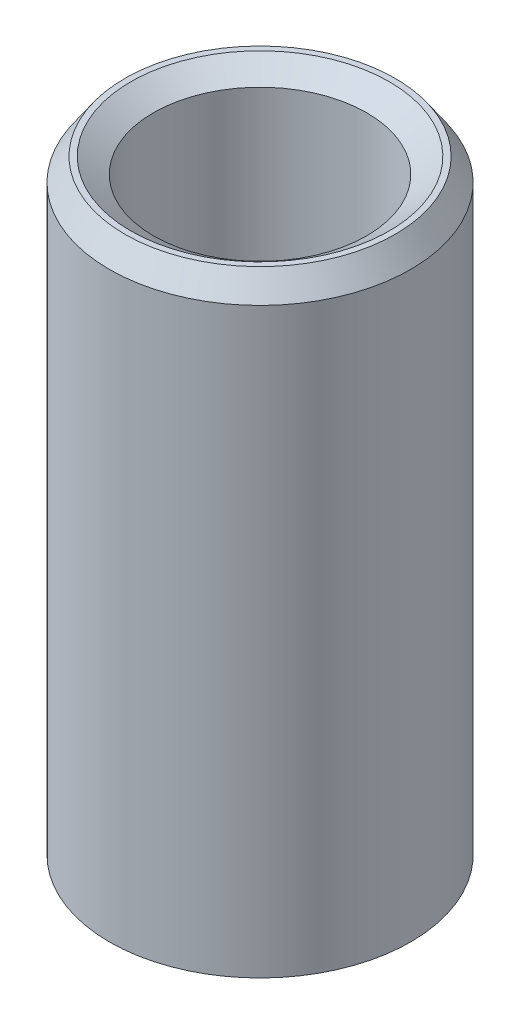
ISO-10303-21;
HEADER;
FILE_DESCRIPTION(('STEP AP214'),'2;1');
FILE_NAME('part.step','',(''),(''),'','','');
FILE_SCHEMA(('AUTOMOTIVE_DESIGN { 1 0 10303 214 1 1 1 1 }'));
ENDSEC;
DATA;
#1=APPLICATION_CONTEXT('core data for automotive mechanical design processes');
#2=APPLICATION_PROTOCOL_DEFINITION('international standard','automotive_design',2000,#1);
#3=PRODUCT_CONTEXT('',#1,'mechanical');
#4=PRODUCT('Part','Part','',(#3));
#5=PRODUCT_RELATED_PRODUCT_CATEGORY('part','',(#4));
#6=PRODUCT_DEFINITION_FORMATION('','',#4);
#7=PRODUCT_DEFINITION_CONTEXT('part definition',#1,'design');
#8=PRODUCT_DEFINITION('design','',#6,#7);
#9=PRODUCT_DEFINITION_SHAPE('','',#8);
#10=(LENGTH_UNIT() NAMED_UNIT(*) SI_UNIT(.MILLI.,.METRE.));
#11=(NAMED_UNIT(*) PLANE_ANGLE_UNIT() SI_UNIT($,.RADIAN.));
#12=(NAMED_UNIT(*) SI_UNIT($,.STERADIAN.) SOLID_ANGLE_UNIT());
#13=UNCERTAINTY_MEASURE_WITH_UNIT(LENGTH_MEASURE(1.E-05),#10,'distance_accuracy_value','');
#14=(GEOMETRIC_REPRESENTATION_CONTEXT(3) GLOBAL_UNCERTAINTY_ASSIGNED_CONTEXT((#13)) GLOBAL_UNIT_ASSIGNED_CONTEXT((#10,
#11,#12)) REPRESENTATION_CONTEXT('',''));
#15=CARTESIAN_POINT('',(0.,0.,0.));
#16=DIRECTION('',(0.,0.,1.));
#17=DIRECTION('',(1.,0.,0.));
#18=AXIS2_PLACEMENT_3D('',#15,#16,#17);
#19=CARTESIAN_POINT('',(0.,61.7826285596453,0.));
#20=DIRECTION('',(0.,-1.,0.));
#21=DIRECTION('',(0.,0.,-1.));
#22=AXIS2_PLACEMENT_3D('',#19,#20,#21);
#23=CYLINDRICAL_SURFACE('',#22,15.);
#24=CARTESIAN_POINT('',(0.,1.54824435285328,0.));
#25=DIRECTION('',(0.,1.,0.));
#26=DIRECTION('',(0.,0.,1.));
#27=AXIS2_PLACEMENT_3D('',#24,#25,#26);
#28=CIRCLE('',#27,15.);
#29=CARTESIAN_POINT('',(0.,1.54824435285328,15.));
#30=VERTEX_POINT('',#29);
#31=EDGE_CURVE('E10',#30,#30,#28,.T.);
#32=ORIENTED_EDGE('',*,*,#31,.T.);
#33=EDGE_LOOP('',(#32));
#34=FACE_BOUND('',#33,.T.);
#35=CARTESIAN_POINT('',(0.,59.5315173070582,0.));
#36=DIRECTION('',(0.,1.,0.));
#37=DIRECTION('',(0.,0.,1.));
#38=AXIS2_PLACEMENT_3D('',#35,#36,#37);
#39=CIRCLE('',#38,15.);
#40=CARTESIAN_POINT('',(0.,59.5315173070582,15.));
#41=VERTEX_POINT('',#40);
#42=EDGE_CURVE('E50',#41,#41,#39,.F.);
#43=ORIENTED_EDGE('',*,*,#42,.T.);
#44=EDGE_LOOP('',(#43));
#45=FACE_BOUND('',#44,.T.);
#46=ADVANCED_FACE('F39',(#34,#45),#23,.T.);
#47=CARTESIAN_POINT('',(0.,61.7826285596453,0.));
#48=DIRECTION('',(0.,1.,0.));
#49=DIRECTION('',(0.,0.,1.));
#50=AXIS2_PLACEMENT_3D('',#47,#48,#49);
#51=PLANE('',#50);
#52=CARTESIAN_POINT('',(0.,61.7826285596453,0.));
#53=DIRECTION('',(0.,1.,0.));
#54=DIRECTION('',(0.,0.,1.));
#55=AXIS2_PLACEMENT_3D('',#52,#53,#54);
#56=CIRCLE('',#55,12.8686352622771);
#57=CARTESIAN_POINT('',(0.,61.7826285596453,12.8686352622771));
#58=VERTEX_POINT('',#57);
#59=EDGE_CURVE('E58',#58,#58,#56,.F.);
#60=ORIENTED_EDGE('',*,*,#59,.T.);
#61=EDGE_LOOP('',(#60));
#62=FACE_BOUND('',#61,.T.);
#63=CARTESIAN_POINT('',(0.,61.7826285596453,0.));
#64=DIRECTION('',(0.,1.,0.));
#65=DIRECTION('',(0.,0.,1.));
#66=AXIS2_PLACEMENT_3D('',#63,#64,#65);
#67=CIRCLE('',#66,13.4517556471467);
#68=CARTESIAN_POINT('',(0.,61.7826285596453,13.4517556471467));
#69=VERTEX_POINT('',#68);
#70=EDGE_CURVE('E61',#69,#69,#67,.T.);
#71=ORIENTED_EDGE('',*,*,#70,.T.);
#72=EDGE_LOOP('',(#71));
#73=FACE_BOUND('',#72,.T.);
#74=ADVANCED_FACE('F88',(#62,#73),#51,.T.);
#75=CARTESIAN_POINT('',(0.,0.,0.));
#76=DIRECTION('',(0.,1.,0.));
#77=DIRECTION('',(0.,0.,1.));
#78=AXIS2_PLACEMENT_3D('',#75,#76,#77);
#79=PLANE('',#78);
#80=CARTESIAN_POINT('',(0.,0.,0.));
#81=DIRECTION('',(0.,1.,0.));
#82=DIRECTION('',(0.,0.,1.));
#83=AXIS2_PLACEMENT_3D('',#80,#81,#82);
#84=CIRCLE('',#83,12.1657683625433);
#85=CARTESIAN_POINT('',(0.,0.,12.1657683625433));
#86=VERTEX_POINT('',#85);
#87=EDGE_CURVE('E51',#86,#86,#84,.T.);
#88=ORIENTED_EDGE('',*,*,#87,.T.);
#89=EDGE_LOOP('',(#88));
#90=FACE_BOUND('',#89,.T.);
#91=CARTESIAN_POINT('',(0.,0.,0.));
#92=DIRECTION('',(0.,1.,0.));
#93=DIRECTION('',(0.,0.,1.));
#94=AXIS2_PLACEMENT_3D('',#91,#92,#93);
#95=CIRCLE('',#94,12.7488887474129);
#96=CARTESIAN_POINT('',(0.,0.,12.7488887474129));
#97=VERTEX_POINT('',#96);
#98=EDGE_CURVE('E54',#97,#97,#95,.F.);
#99=ORIENTED_EDGE('',*,*,#98,.T.);
#100=EDGE_LOOP('',(#99));
#101=FACE_BOUND('',#100,.T.);
#102=ADVANCED_FACE('F83',(#90,#101),#79,.F.);
#103=CARTESIAN_POINT('',(0.,61.7826285596453,0.));
#104=DIRECTION('',(0.,-1.,0.));
#105=DIRECTION('',(0.,0.,-1.));
#106=AXIS2_PLACEMENT_3D('',#103,#104,#105);
#107=CYLINDRICAL_SURFACE('',#106,10.61752400969);
#108=CARTESIAN_POINT('',(0.,60.234384206792,0.));
#109=DIRECTION('',(0.,1.,0.));
#110=DIRECTION('',(0.,0.,1.));
#111=AXIS2_PLACEMENT_3D('',#108,#109,#110);
#112=CIRCLE('',#111,10.61752400969);
#113=CARTESIAN_POINT('',(0.,60.234384206792,10.61752400969));
#114=VERTEX_POINT('',#113);
#115=EDGE_CURVE('E67',#114,#114,#112,.T.);
#116=ORIENTED_EDGE('',*,*,#115,.T.);
#117=EDGE_LOOP('',(#116));
#118=FACE_BOUND('',#117,.T.);
#119=CARTESIAN_POINT('',(0.,2.25111125258712,0.));
#120=DIRECTION('',(0.,1.,0.));
#121=DIRECTION('',(0.,0.,1.));
#122=AXIS2_PLACEMENT_3D('',#119,#120,#121);
#123=CIRCLE('',#122,10.61752400969);
#124=CARTESIAN_POINT('',(0.,2.25111125258712,10.61752400969));
#125=VERTEX_POINT('',#124);
#126=EDGE_CURVE('E69',#125,#125,#123,.F.);
#127=ORIENTED_EDGE('',*,*,#126,.T.);
#128=EDGE_LOOP('',(#127));
#129=FACE_BOUND('',#128,.T.);
#130=ADVANCED_FACE('F71',(#118,#129),#107,.F.);
#131=CARTESIAN_POINT('',(0.,60.234384206792,0.));
#132=DIRECTION('',(0.,1.,0.));
#133=DIRECTION('',(0.,0.,1.));
#134=AXIS2_PLACEMENT_3D('',#131,#132,#133);
#135=CONICAL_SURFACE('',#134,10.61752400969,0.96832639542296);
#136=ORIENTED_EDGE('',*,*,#59,.F.);
#137=EDGE_LOOP('',(#136));
#138=FACE_BOUND('',#137,.T.);
#139=ORIENTED_EDGE('',*,*,#115,.F.);
#140=EDGE_LOOP('',(#139));
#141=FACE_BOUND('',#140,.T.);
#142=ADVANCED_FACE('F77',(#138,#141),#135,.F.);
#143=CARTESIAN_POINT('',(0.,0.,0.));
#144=DIRECTION('',(0.,-1.,0.));
#145=DIRECTION('',(0.,0.,-1.));
#146=AXIS2_PLACEMENT_3D('',#143,#144,#145);
#147=CONICAL_SURFACE('',#146,12.1657683625433,0.602469931371938);
#148=ORIENTED_EDGE('',*,*,#126,.F.);
#149=EDGE_LOOP('',(#148));
#150=FACE_BOUND('',#149,.T.);
#151=ORIENTED_EDGE('',*,*,#87,.F.);
#152=EDGE_LOOP('',(#151));
#153=FACE_BOUND('',#152,.T.);
#154=ADVANCED_FACE('F73',(#150,#153),#147,.F.);
#155=CARTESIAN_POINT('',(0.,1.54824435285328,0.));
#156=DIRECTION('',(0.,1.,0.));
#157=DIRECTION('',(0.,0.,1.));
#158=AXIS2_PLACEMENT_3D('',#155,#156,#157);
#159=CONICAL_SURFACE('',#158,15.,0.968326395422962);
#160=ORIENTED_EDGE('',*,*,#98,.F.);
#161=EDGE_LOOP('',(#160));
#162=FACE_BOUND('',#161,.T.);
#163=ORIENTED_EDGE('',*,*,#31,.F.);
#164=EDGE_LOOP('',(#163));
#165=FACE_BOUND('',#164,.T.);
#166=ADVANCED_FACE('F76',(#162,#165),#159,.T.);
#167=CARTESIAN_POINT('',(0.,61.7826285596453,0.));
#168=DIRECTION('',(0.,-1.,0.));
#169=DIRECTION('',(0.,0.,-1.));
#170=AXIS2_PLACEMENT_3D('',#167,#168,#169);
#171=CONICAL_SURFACE('',#170,13.4517556471467,0.602469931371935);
#172=ORIENTED_EDGE('',*,*,#42,.F.);
#173=EDGE_LOOP('',(#172));
#174=FACE_BOUND('',#173,.T.);
#175=ORIENTED_EDGE('',*,*,#70,.F.);
#176=EDGE_LOOP('',(#175));
#177=FACE_BOUND('',#176,.T.);
#178=ADVANCED_FACE('F45',(#174,#177),#171,.T.);
#179=CLOSED_SHELL('',(#46,#74,#102,#130,#142,#154,#166,#178));
#180=MANIFOLD_SOLID_BREP('B2',#179);
#181=ADVANCED_BREP_SHAPE_REPRESENTATION('',(#18,#180),#14);
#182=SHAPE_DEFINITION_REPRESENTATION(#9,#181);
ENDSEC;
END-ISO-10303-21;
